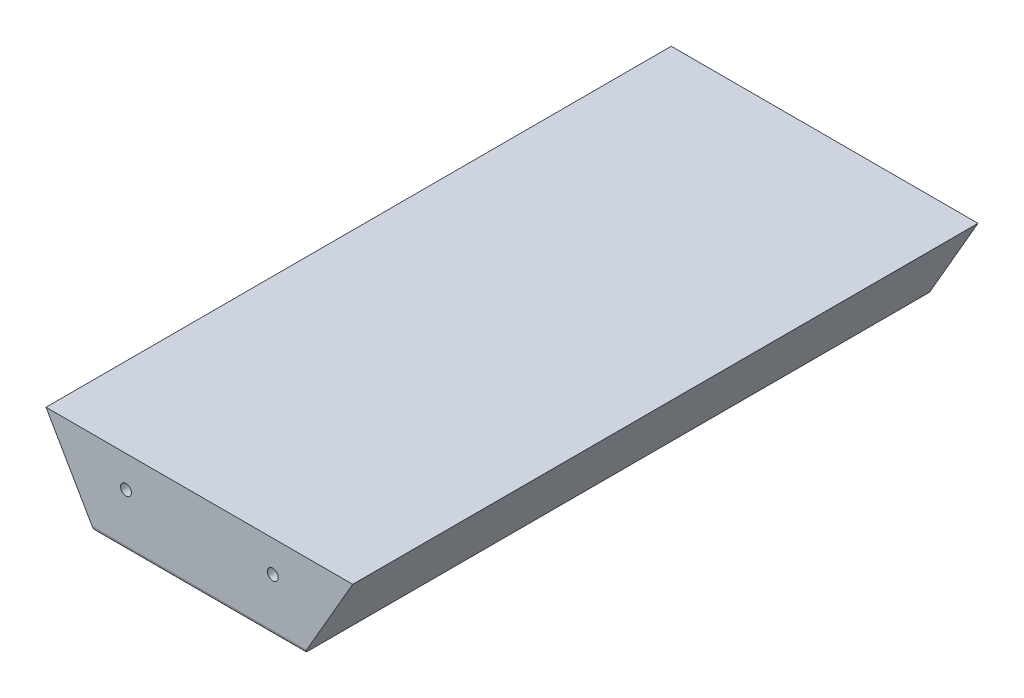
ISO-10303-21;
HEADER;
FILE_DESCRIPTION(('STEP AP214'),'2;1');
FILE_NAME('part.step','',(''),(''),'','','');
FILE_SCHEMA(('AUTOMOTIVE_DESIGN { 1 0 10303 214 1 1 1 1 }'));
ENDSEC;
DATA;
#1=APPLICATION_CONTEXT('core data for automotive mechanical design processes');
#2=APPLICATION_PROTOCOL_DEFINITION('international standard','automotive_design',2000,#1);
#3=PRODUCT_CONTEXT('',#1,'mechanical');
#4=PRODUCT('Part','Part','',(#3));
#5=PRODUCT_RELATED_PRODUCT_CATEGORY('part','',(#4));
#6=PRODUCT_DEFINITION_FORMATION('','',#4);
#7=PRODUCT_DEFINITION_CONTEXT('part definition',#1,'design');
#8=PRODUCT_DEFINITION('design','',#6,#7);
#9=PRODUCT_DEFINITION_SHAPE('','',#8);
#10=(LENGTH_UNIT() NAMED_UNIT(*) SI_UNIT(.MILLI.,.METRE.));
#11=(NAMED_UNIT(*) PLANE_ANGLE_UNIT() SI_UNIT($,.RADIAN.));
#12=(NAMED_UNIT(*) SI_UNIT($,.STERADIAN.) SOLID_ANGLE_UNIT());
#13=UNCERTAINTY_MEASURE_WITH_UNIT(LENGTH_MEASURE(1.E-05),#10,'distance_accuracy_value','');
#14=(GEOMETRIC_REPRESENTATION_CONTEXT(3) GLOBAL_UNCERTAINTY_ASSIGNED_CONTEXT((#13)) GLOBAL_UNIT_ASSIGNED_CONTEXT((#10,
#11,#12)) REPRESENTATION_CONTEXT('',''));
#15=CARTESIAN_POINT('',(0.,0.,0.));
#16=DIRECTION('',(0.,0.,1.));
#17=DIRECTION('',(1.,0.,0.));
#18=AXIS2_PLACEMENT_3D('',#15,#16,#17);
#19=CARTESIAN_POINT('',(-50.,0.,100.));
#20=DIRECTION('',(0.86602540378444,0.499999999999998,0.));
#21=DIRECTION('',(-0.499999999999998,0.86602540378444,0.));
#22=AXIS2_PLACEMENT_3D('',#19,#20,#21);
#23=PLANE('',#22);
#24=DIRECTION('',(0.,0.,-1.));
#25=VECTOR('',#24,1.);
#26=CARTESIAN_POINT('',(-50.,0.,100.));
#27=LINE('',#26,#25);
#28=CARTESIAN_POINT('',(-50.,0.,146.2));
#29=VERTEX_POINT('',#28);
#30=CARTESIAN_POINT('',(-50.,0.,-150.));
#31=VERTEX_POINT('',#30);
#32=EDGE_CURVE('E141',#29,#31,#27,.T.);
#33=ORIENTED_EDGE('',*,*,#32,.F.);
#34=CARTESIAN_POINT('',(-51.0392304845413,1.79999999999999,146.2));
#35=DIRECTION('',(0.86602540378444,0.499999999999998,0.));
#36=DIRECTION('',(-0.499999999999998,0.86602540378444,0.));
#37=AXIS2_PLACEMENT_3D('',#34,#35,#36);
#38=ELLIPSE('',#37,2.07846096908265,1.8);
#39=CARTESIAN_POINT('',(-51.0392304845413,1.79999999999999,148.));
#40=VERTEX_POINT('',#39);
#41=EDGE_CURVE('E11',#29,#40,#38,.F.);
#42=ORIENTED_EDGE('',*,*,#41,.T.);
#43=DIRECTION('',(0.499999999999998,-0.86602540378444,0.));
#44=VECTOR('',#43,1.);
#45=CARTESIAN_POINT('',(-73.0940107675849,40.,148.));
#46=LINE('',#45,#44);
#47=CARTESIAN_POINT('',(-73.0940107675849,40.,148.));
#48=VERTEX_POINT('',#47);
#49=EDGE_CURVE('E95',#48,#40,#46,.T.);
#50=ORIENTED_EDGE('',*,*,#49,.F.);
#51=DIRECTION('',(0.,0.,-1.));
#52=VECTOR('',#51,1.);
#53=CARTESIAN_POINT('',(-73.0940107675849,40.,100.));
#54=LINE('',#53,#52);
#55=CARTESIAN_POINT('',(-73.0940107675849,40.,-150.));
#56=VERTEX_POINT('',#55);
#57=EDGE_CURVE('E106',#48,#56,#54,.T.);
#58=ORIENTED_EDGE('',*,*,#57,.T.);
#59=DIRECTION('',(-0.499999999999998,0.86602540378444,0.));
#60=VECTOR('',#59,1.);
#61=CARTESIAN_POINT('',(-73.0940107675849,40.,-150.));
#62=LINE('',#61,#60);
#63=EDGE_CURVE('E109',#31,#56,#62,.T.);
#64=ORIENTED_EDGE('',*,*,#63,.F.);
#65=EDGE_LOOP('',(#33,#42,#50,#58,#64));
#66=FACE_BOUND('',#65,.T.);
#67=ADVANCED_FACE('F41',(#66),#23,.F.);
#68=CARTESIAN_POINT('',(50.,0.,100.));
#69=DIRECTION('',(0.,1.,0.));
#70=DIRECTION('',(-1.,0.,0.));
#71=AXIS2_PLACEMENT_3D('',#68,#69,#70);
#72=PLANE('',#71);
#73=CARTESIAN_POINT('',(0.,0.,70.));
#74=DIRECTION('',(0.,-1.,0.));
#75=DIRECTION('',(1.,0.,0.));
#76=AXIS2_PLACEMENT_3D('',#73,#74,#75);
#77=CIRCLE('',#76,5.);
#78=CARTESIAN_POINT('',(5.00000000000001,0.,70.));
#79=VERTEX_POINT('',#78);
#80=EDGE_CURVE('E125',#79,#79,#77,.T.);
#81=ORIENTED_EDGE('',*,*,#80,.F.);
#82=EDGE_LOOP('',(#81));
#83=FACE_BOUND('',#82,.T.);
#84=CARTESIAN_POINT('',(0.,0.,0.));
#85=DIRECTION('',(0.,-1.,0.));
#86=DIRECTION('',(1.,0.,0.));
#87=AXIS2_PLACEMENT_3D('',#84,#85,#86);
#88=CIRCLE('',#87,5.);
#89=CARTESIAN_POINT('',(5.00000000000001,0.,0.));
#90=VERTEX_POINT('',#89);
#91=EDGE_CURVE('E131',#90,#90,#88,.T.);
#92=ORIENTED_EDGE('',*,*,#91,.F.);
#93=EDGE_LOOP('',(#92));
#94=FACE_BOUND('',#93,.T.);
#95=CARTESIAN_POINT('',(0.,0.,-70.));
#96=DIRECTION('',(0.,-1.,0.));
#97=DIRECTION('',(1.,0.,0.));
#98=AXIS2_PLACEMENT_3D('',#95,#96,#97);
#99=CIRCLE('',#98,5.);
#100=CARTESIAN_POINT('',(5.00000000000002,0.,-70.));
#101=VERTEX_POINT('',#100);
#102=EDGE_CURVE('E121',#101,#101,#99,.T.);
#103=ORIENTED_EDGE('',*,*,#102,.F.);
#104=EDGE_LOOP('',(#103));
#105=FACE_BOUND('',#104,.T.);
#106=DIRECTION('',(0.,0.,-1.));
#107=VECTOR('',#106,1.);
#108=CARTESIAN_POINT('',(50.,0.,100.));
#109=LINE('',#108,#107);
#110=CARTESIAN_POINT('',(50.,0.,146.2));
#111=VERTEX_POINT('',#110);
#112=CARTESIAN_POINT('',(50.,0.,-150.));
#113=VERTEX_POINT('',#112);
#114=EDGE_CURVE('E105',#111,#113,#109,.T.);
#115=ORIENTED_EDGE('',*,*,#114,.F.);
#116=DIRECTION('',(1.,0.,0.));
#117=VECTOR('',#116,1.);
#118=CARTESIAN_POINT('',(-50.,0.,146.2));
#119=LINE('',#118,#117);
#120=EDGE_CURVE('E49',#111,#29,#119,.F.);
#121=ORIENTED_EDGE('',*,*,#120,.T.);
#122=ORIENTED_EDGE('',*,*,#32,.T.);
#123=DIRECTION('',(-1.,0.,0.));
#124=VECTOR('',#123,1.);
#125=CARTESIAN_POINT('',(-50.,0.,-150.));
#126=LINE('',#125,#124);
#127=EDGE_CURVE('E118',#113,#31,#126,.T.);
#128=ORIENTED_EDGE('',*,*,#127,.F.);
#129=EDGE_LOOP('',(#115,#121,#122,#128));
#130=FACE_BOUND('',#129,.T.);
#131=ADVANCED_FACE('F145',(#83,#94,#105,#130),#72,.F.);
#132=CARTESIAN_POINT('',(73.0940107675849,40.,100.));
#133=DIRECTION('',(-0.86602540378444,0.499999999999998,0.));
#134=DIRECTION('',(-0.499999999999998,-0.86602540378444,0.));
#135=AXIS2_PLACEMENT_3D('',#132,#133,#134);
#136=PLANE('',#135);
#137=DIRECTION('',(0.499999999999998,0.86602540378444,0.));
#138=VECTOR('',#137,1.);
#139=CARTESIAN_POINT('',(50.,0.,148.));
#140=LINE('',#139,#138);
#141=CARTESIAN_POINT('',(51.0392304845413,1.80000000000002,148.));
#142=VERTEX_POINT('',#141);
#143=CARTESIAN_POINT('',(73.0940107675849,40.,148.));
#144=VERTEX_POINT('',#143);
#145=EDGE_CURVE('E86',#142,#144,#140,.T.);
#146=ORIENTED_EDGE('',*,*,#145,.F.);
#147=CARTESIAN_POINT('',(51.0392304845413,1.80000000000002,146.2));
#148=DIRECTION('',(-0.86602540378444,0.499999999999998,0.));
#149=DIRECTION('',(-0.499999999999998,-0.86602540378444,0.));
#150=AXIS2_PLACEMENT_3D('',#147,#148,#149);
#151=ELLIPSE('',#150,2.07846096908265,1.8);
#152=EDGE_CURVE('E63',#142,#111,#151,.F.);
#153=ORIENTED_EDGE('',*,*,#152,.T.);
#154=ORIENTED_EDGE('',*,*,#114,.T.);
#155=DIRECTION('',(-0.499999999999998,-0.86602540378444,0.));
#156=VECTOR('',#155,1.);
#157=CARTESIAN_POINT('',(50.,0.,-150.));
#158=LINE('',#157,#156);
#159=CARTESIAN_POINT('',(73.0940107675849,40.,-150.));
#160=VERTEX_POINT('',#159);
#161=EDGE_CURVE('E101',#160,#113,#158,.T.);
#162=ORIENTED_EDGE('',*,*,#161,.F.);
#163=DIRECTION('',(0.,0.,-1.));
#164=VECTOR('',#163,1.);
#165=CARTESIAN_POINT('',(73.0940107675849,40.,100.));
#166=LINE('',#165,#164);
#167=EDGE_CURVE('E98',#144,#160,#166,.T.);
#168=ORIENTED_EDGE('',*,*,#167,.F.);
#169=EDGE_LOOP('',(#146,#153,#154,#162,#168));
#170=FACE_BOUND('',#169,.T.);
#171=ADVANCED_FACE('F99',(#170),#136,.F.);
#172=CARTESIAN_POINT('',(-73.0940107675849,40.,100.));
#173=DIRECTION('',(0.,-1.,0.));
#174=DIRECTION('',(0.,0.,-1.));
#175=AXIS2_PLACEMENT_3D('',#172,#173,#174);
#176=PLANE('',#175);
#177=ORIENTED_EDGE('',*,*,#167,.T.);
#178=DIRECTION('',(1.,0.,0.));
#179=VECTOR('',#178,1.);
#180=CARTESIAN_POINT('',(73.0940107675849,40.,-150.));
#181=LINE('',#180,#179);
#182=EDGE_CURVE('E112',#56,#160,#181,.T.);
#183=ORIENTED_EDGE('',*,*,#182,.F.);
#184=ORIENTED_EDGE('',*,*,#57,.F.);
#185=DIRECTION('',(-1.,0.,0.));
#186=VECTOR('',#185,1.);
#187=CARTESIAN_POINT('',(73.0940107675849,40.,148.));
#188=LINE('',#187,#186);
#189=EDGE_CURVE('E91',#144,#48,#188,.T.);
#190=ORIENTED_EDGE('',*,*,#189,.F.);
#191=EDGE_LOOP('',(#177,#183,#184,#190));
#192=FACE_BOUND('',#191,.T.);
#193=ADVANCED_FACE('F108',(#192),#176,.F.);
#194=CARTESIAN_POINT('',(0.,15.,-70.));
#195=DIRECTION('',(0.,-1.,0.));
#196=DIRECTION('',(1.,0.,0.));
#197=AXIS2_PLACEMENT_3D('',#194,#195,#196);
#198=CYLINDRICAL_SURFACE('',#197,5.);
#199=CARTESIAN_POINT('',(0.,15.,-70.));
#200=DIRECTION('',(0.,-1.,0.));
#201=DIRECTION('',(1.,0.,0.));
#202=AXIS2_PLACEMENT_3D('',#199,#200,#201);
#203=CIRCLE('',#202,5.);
#204=CARTESIAN_POINT('',(5.00000000000002,15.,-70.));
#205=VERTEX_POINT('',#204);
#206=EDGE_CURVE('E134',#205,#205,#203,.T.);
#207=ORIENTED_EDGE('',*,*,#206,.F.);
#208=EDGE_LOOP('',(#207));
#209=FACE_BOUND('',#208,.T.);
#210=ORIENTED_EDGE('',*,*,#102,.T.);
#211=EDGE_LOOP('',(#210));
#212=FACE_BOUND('',#211,.T.);
#213=ADVANCED_FACE('F218',(#209,#212),#198,.F.);
#214=CARTESIAN_POINT('',(0.,15.,-70.));
#215=DIRECTION('',(0.,-1.,0.));
#216=DIRECTION('',(1.,0.,0.));
#217=AXIS2_PLACEMENT_3D('',#214,#215,#216);
#218=PLANE('',#217);
#219=ORIENTED_EDGE('',*,*,#206,.T.);
#220=EDGE_LOOP('',(#219));
#221=FACE_BOUND('',#220,.T.);
#222=ADVANCED_FACE('F221',(#221),#218,.T.);
#223=CARTESIAN_POINT('',(0.,15.,0.));
#224=DIRECTION('',(0.,-1.,0.));
#225=DIRECTION('',(1.,0.,0.));
#226=AXIS2_PLACEMENT_3D('',#223,#224,#225);
#227=CYLINDRICAL_SURFACE('',#226,5.);
#228=CARTESIAN_POINT('',(0.,15.,0.));
#229=DIRECTION('',(0.,-1.,0.));
#230=DIRECTION('',(1.,0.,0.));
#231=AXIS2_PLACEMENT_3D('',#228,#229,#230);
#232=CIRCLE('',#231,5.);
#233=CARTESIAN_POINT('',(5.00000000000001,15.,0.));
#234=VERTEX_POINT('',#233);
#235=EDGE_CURVE('E128',#234,#234,#232,.T.);
#236=ORIENTED_EDGE('',*,*,#235,.F.);
#237=EDGE_LOOP('',(#236));
#238=FACE_BOUND('',#237,.T.);
#239=ORIENTED_EDGE('',*,*,#91,.T.);
#240=EDGE_LOOP('',(#239));
#241=FACE_BOUND('',#240,.T.);
#242=ADVANCED_FACE('F225',(#238,#241),#227,.F.);
#243=CARTESIAN_POINT('',(0.,15.,0.));
#244=DIRECTION('',(0.,-1.,0.));
#245=DIRECTION('',(1.,0.,0.));
#246=AXIS2_PLACEMENT_3D('',#243,#244,#245);
#247=PLANE('',#246);
#248=ORIENTED_EDGE('',*,*,#235,.T.);
#249=EDGE_LOOP('',(#248));
#250=FACE_BOUND('',#249,.T.);
#251=ADVANCED_FACE('F229',(#250),#247,.T.);
#252=CARTESIAN_POINT('',(0.,15.,70.));
#253=DIRECTION('',(0.,-1.,0.));
#254=DIRECTION('',(1.,0.,0.));
#255=AXIS2_PLACEMENT_3D('',#252,#253,#254);
#256=CYLINDRICAL_SURFACE('',#255,5.);
#257=CARTESIAN_POINT('',(0.,15.,70.));
#258=DIRECTION('',(0.,-1.,0.));
#259=DIRECTION('',(1.,0.,0.));
#260=AXIS2_PLACEMENT_3D('',#257,#258,#259);
#261=CIRCLE('',#260,5.);
#262=CARTESIAN_POINT('',(5.,15.,70.));
#263=VERTEX_POINT('',#262);
#264=EDGE_CURVE('E122',#263,#263,#261,.T.);
#265=ORIENTED_EDGE('',*,*,#264,.F.);
#266=EDGE_LOOP('',(#265));
#267=FACE_BOUND('',#266,.T.);
#268=ORIENTED_EDGE('',*,*,#80,.T.);
#269=EDGE_LOOP('',(#268));
#270=FACE_BOUND('',#269,.T.);
#271=ADVANCED_FACE('F233',(#267,#270),#256,.F.);
#272=CARTESIAN_POINT('',(0.,15.,70.));
#273=DIRECTION('',(0.,-1.,0.));
#274=DIRECTION('',(1.,0.,0.));
#275=AXIS2_PLACEMENT_3D('',#272,#273,#274);
#276=PLANE('',#275);
#277=ORIENTED_EDGE('',*,*,#264,.T.);
#278=EDGE_LOOP('',(#277));
#279=FACE_BOUND('',#278,.T.);
#280=ADVANCED_FACE('F188',(#279),#276,.T.);
#281=CARTESIAN_POINT('',(0.,0.,-150.));
#282=DIRECTION('',(0.,0.,1.));
#283=DIRECTION('',(1.,0.,0.));
#284=AXIS2_PLACEMENT_3D('',#281,#282,#283);
#285=PLANE('',#284);
#286=CARTESIAN_POINT('',(35.,25.,-150.));
#287=DIRECTION('',(0.,0.,-1.));
#288=DIRECTION('',(-1.,0.,0.));
#289=AXIS2_PLACEMENT_3D('',#286,#287,#288);
#290=CIRCLE('',#289,2.6);
#291=CARTESIAN_POINT('',(32.4,25.,-150.));
#292=VERTEX_POINT('',#291);
#293=EDGE_CURVE('E171',#292,#292,#290,.T.);
#294=ORIENTED_EDGE('',*,*,#293,.F.);
#295=EDGE_LOOP('',(#294));
#296=FACE_BOUND('',#295,.T.);
#297=CARTESIAN_POINT('',(-35.,25.,-150.));
#298=DIRECTION('',(0.,0.,-1.));
#299=DIRECTION('',(-1.,0.,0.));
#300=AXIS2_PLACEMENT_3D('',#297,#298,#299);
#301=CIRCLE('',#300,2.6);
#302=CARTESIAN_POINT('',(-37.6,25.,-150.));
#303=VERTEX_POINT('',#302);
#304=EDGE_CURVE('E165',#303,#303,#301,.T.);
#305=ORIENTED_EDGE('',*,*,#304,.F.);
#306=EDGE_LOOP('',(#305));
#307=FACE_BOUND('',#306,.T.);
#308=ORIENTED_EDGE('',*,*,#63,.T.);
#309=ORIENTED_EDGE('',*,*,#182,.T.);
#310=ORIENTED_EDGE('',*,*,#161,.T.);
#311=ORIENTED_EDGE('',*,*,#127,.T.);
#312=EDGE_LOOP('',(#308,#309,#310,#311));
#313=FACE_BOUND('',#312,.T.);
#314=ADVANCED_FACE('F150',(#296,#307,#313),#285,.F.);
#315=CARTESIAN_POINT('',(0.,0.,148.));
#316=DIRECTION('',(0.,0.,1.));
#317=DIRECTION('',(1.,0.,0.));
#318=AXIS2_PLACEMENT_3D('',#315,#316,#317);
#319=PLANE('',#318);
#320=CARTESIAN_POINT('',(-35.,25.,148.));
#321=DIRECTION('',(0.,0.,1.));
#322=DIRECTION('',(1.,0.,0.));
#323=AXIS2_PLACEMENT_3D('',#320,#321,#322);
#324=CIRCLE('',#323,2.6);
#325=CARTESIAN_POINT('',(-32.4,25.,148.));
#326=VERTEX_POINT('',#325);
#327=EDGE_CURVE('E153',#326,#326,#324,.T.);
#328=ORIENTED_EDGE('',*,*,#327,.F.);
#329=EDGE_LOOP('',(#328));
#330=FACE_BOUND('',#329,.T.);
#331=CARTESIAN_POINT('',(35.,25.,148.));
#332=DIRECTION('',(0.,0.,1.));
#333=DIRECTION('',(-1.,0.,0.));
#334=AXIS2_PLACEMENT_3D('',#331,#332,#333);
#335=CIRCLE('',#334,2.6);
#336=CARTESIAN_POINT('',(32.4,25.,148.));
#337=VERTEX_POINT('',#336);
#338=EDGE_CURVE('E156',#337,#337,#335,.T.);
#339=ORIENTED_EDGE('',*,*,#338,.F.);
#340=EDGE_LOOP('',(#339));
#341=FACE_BOUND('',#340,.T.);
#342=ORIENTED_EDGE('',*,*,#49,.T.);
#343=DIRECTION('',(1.,0.,0.));
#344=VECTOR('',#343,1.);
#345=CARTESIAN_POINT('',(50.,1.80000000000002,148.));
#346=LINE('',#345,#344);
#347=EDGE_CURVE('E94',#40,#142,#346,.T.);
#348=ORIENTED_EDGE('',*,*,#347,.T.);
#349=ORIENTED_EDGE('',*,*,#145,.T.);
#350=ORIENTED_EDGE('',*,*,#189,.T.);
#351=EDGE_LOOP('',(#342,#348,#349,#350));
#352=FACE_BOUND('',#351,.T.);
#353=ADVANCED_FACE('F89',(#330,#341,#352),#319,.T.);
#354=CARTESIAN_POINT('',(0.,1.8,146.2));
#355=DIRECTION('',(-1.,0.,0.));
#356=DIRECTION('',(0.,-1.,0.));
#357=AXIS2_PLACEMENT_3D('',#354,#355,#356);
#358=CYLINDRICAL_SURFACE('',#357,1.8);
#359=ORIENTED_EDGE('',*,*,#41,.F.);
#360=ORIENTED_EDGE('',*,*,#120,.F.);
#361=ORIENTED_EDGE('',*,*,#152,.F.);
#362=ORIENTED_EDGE('',*,*,#347,.F.);
#363=EDGE_LOOP('',(#359,#360,#361,#362));
#364=FACE_BOUND('',#363,.T.);
#365=ADVANCED_FACE('F43',(#364),#358,.T.);
#366=CARTESIAN_POINT('',(35.,25.,133.));
#367=DIRECTION('',(0.,0.,1.));
#368=DIRECTION('',(1.,0.,0.));
#369=AXIS2_PLACEMENT_3D('',#366,#367,#368);
#370=CYLINDRICAL_SURFACE('',#369,2.6);
#371=CARTESIAN_POINT('',(35.,25.,133.));
#372=DIRECTION('',(0.,0.,1.));
#373=DIRECTION('',(-1.,0.,0.));
#374=AXIS2_PLACEMENT_3D('',#371,#372,#373);
#375=CIRCLE('',#374,2.6);
#376=CARTESIAN_POINT('',(32.4,25.,133.));
#377=VERTEX_POINT('',#376);
#378=EDGE_CURVE('E159',#377,#377,#375,.T.);
#379=ORIENTED_EDGE('',*,*,#378,.F.);
#380=EDGE_LOOP('',(#379));
#381=FACE_BOUND('',#380,.T.);
#382=ORIENTED_EDGE('',*,*,#338,.T.);
#383=EDGE_LOOP('',(#382));
#384=FACE_BOUND('',#383,.T.);
#385=ADVANCED_FACE('F244',(#381,#384),#370,.F.);
#386=CARTESIAN_POINT('',(35.,25.,133.));
#387=DIRECTION('',(0.,0.,-1.));
#388=DIRECTION('',(-1.,0.,0.));
#389=AXIS2_PLACEMENT_3D('',#386,#387,#388);
#390=PLANE('',#389);
#391=ORIENTED_EDGE('',*,*,#378,.T.);
#392=EDGE_LOOP('',(#391));
#393=FACE_BOUND('',#392,.T.);
#394=ADVANCED_FACE('F247',(#393),#390,.F.);
#395=CARTESIAN_POINT('',(-35.,25.,133.));
#396=DIRECTION('',(0.,0.,1.));
#397=DIRECTION('',(1.,0.,0.));
#398=AXIS2_PLACEMENT_3D('',#395,#396,#397);
#399=CYLINDRICAL_SURFACE('',#398,2.6);
#400=CARTESIAN_POINT('',(-35.,25.,133.));
#401=DIRECTION('',(0.,0.,1.));
#402=DIRECTION('',(1.,0.,0.));
#403=AXIS2_PLACEMENT_3D('',#400,#401,#402);
#404=CIRCLE('',#403,2.6);
#405=CARTESIAN_POINT('',(-32.4,25.,133.));
#406=VERTEX_POINT('',#405);
#407=EDGE_CURVE('E151',#406,#406,#404,.T.);
#408=ORIENTED_EDGE('',*,*,#407,.F.);
#409=EDGE_LOOP('',(#408));
#410=FACE_BOUND('',#409,.T.);
#411=ORIENTED_EDGE('',*,*,#327,.T.);
#412=EDGE_LOOP('',(#411));
#413=FACE_BOUND('',#412,.T.);
#414=ADVANCED_FACE('F203',(#410,#413),#399,.F.);
#415=CARTESIAN_POINT('',(-35.,25.,133.));
#416=DIRECTION('',(0.,0.,1.));
#417=DIRECTION('',(1.,0.,0.));
#418=AXIS2_PLACEMENT_3D('',#415,#416,#417);
#419=PLANE('',#418);
#420=ORIENTED_EDGE('',*,*,#407,.T.);
#421=EDGE_LOOP('',(#420));
#422=FACE_BOUND('',#421,.T.);
#423=ADVANCED_FACE('F194',(#422),#419,.T.);
#424=CARTESIAN_POINT('',(-35.,25.,-135.));
#425=DIRECTION('',(0.,0.,-1.));
#426=DIRECTION('',(-1.,0.,0.));
#427=AXIS2_PLACEMENT_3D('',#424,#425,#426);
#428=CYLINDRICAL_SURFACE('',#427,2.6);
#429=CARTESIAN_POINT('',(-35.,25.,-135.));
#430=DIRECTION('',(0.,0.,-1.));
#431=DIRECTION('',(-1.,0.,0.));
#432=AXIS2_PLACEMENT_3D('',#429,#430,#431);
#433=CIRCLE('',#432,2.6);
#434=CARTESIAN_POINT('',(-37.6,25.,-135.));
#435=VERTEX_POINT('',#434);
#436=EDGE_CURVE('E168',#435,#435,#433,.T.);
#437=ORIENTED_EDGE('',*,*,#436,.F.);
#438=EDGE_LOOP('',(#437));
#439=FACE_BOUND('',#438,.T.);
#440=ORIENTED_EDGE('',*,*,#304,.T.);
#441=EDGE_LOOP('',(#440));
#442=FACE_BOUND('',#441,.T.);
#443=ADVANCED_FACE('F192',(#439,#442),#428,.F.);
#444=CARTESIAN_POINT('',(-35.,25.,-135.));
#445=DIRECTION('',(0.,0.,-1.));
#446=DIRECTION('',(-1.,0.,0.));
#447=AXIS2_PLACEMENT_3D('',#444,#445,#446);
#448=PLANE('',#447);
#449=ORIENTED_EDGE('',*,*,#436,.T.);
#450=EDGE_LOOP('',(#449));
#451=FACE_BOUND('',#450,.T.);
#452=ADVANCED_FACE('F182',(#451),#448,.T.);
#453=CARTESIAN_POINT('',(35.,25.,-135.));
#454=DIRECTION('',(0.,0.,-1.));
#455=DIRECTION('',(-1.,0.,0.));
#456=AXIS2_PLACEMENT_3D('',#453,#454,#455);
#457=CYLINDRICAL_SURFACE('',#456,2.6);
#458=CARTESIAN_POINT('',(35.,25.,-135.));
#459=DIRECTION('',(0.,0.,-1.));
#460=DIRECTION('',(-1.,0.,0.));
#461=AXIS2_PLACEMENT_3D('',#458,#459,#460);
#462=CIRCLE('',#461,2.6);
#463=CARTESIAN_POINT('',(32.4,25.,-135.));
#464=VERTEX_POINT('',#463);
#465=EDGE_CURVE('E160',#464,#464,#462,.T.);
#466=ORIENTED_EDGE('',*,*,#465,.F.);
#467=EDGE_LOOP('',(#466));
#468=FACE_BOUND('',#467,.T.);
#469=ORIENTED_EDGE('',*,*,#293,.T.);
#470=EDGE_LOOP('',(#469));
#471=FACE_BOUND('',#470,.T.);
#472=ADVANCED_FACE('F179',(#468,#471),#457,.F.);
#473=CARTESIAN_POINT('',(35.,25.,-135.));
#474=DIRECTION('',(0.,0.,-1.));
#475=DIRECTION('',(-1.,0.,0.));
#476=AXIS2_PLACEMENT_3D('',#473,#474,#475);
#477=PLANE('',#476);
#478=ORIENTED_EDGE('',*,*,#465,.T.);
#479=EDGE_LOOP('',(#478));
#480=FACE_BOUND('',#479,.T.);
#481=ADVANCED_FACE('F177',(#480),#477,.T.);
#482=CLOSED_SHELL('',(#67,#131,#171,#193,#213,#222,#242,#251,#271,#280,#314,#353,#365,#385,#394,
#414,#423,#443,#452,#472,#481));
#483=MANIFOLD_SOLID_BREP('B2',#482);
#484=ADVANCED_BREP_SHAPE_REPRESENTATION('',(#18,#483),#14);
#485=SHAPE_DEFINITION_REPRESENTATION(#9,#484);
ENDSEC;
END-ISO-10303-21;
